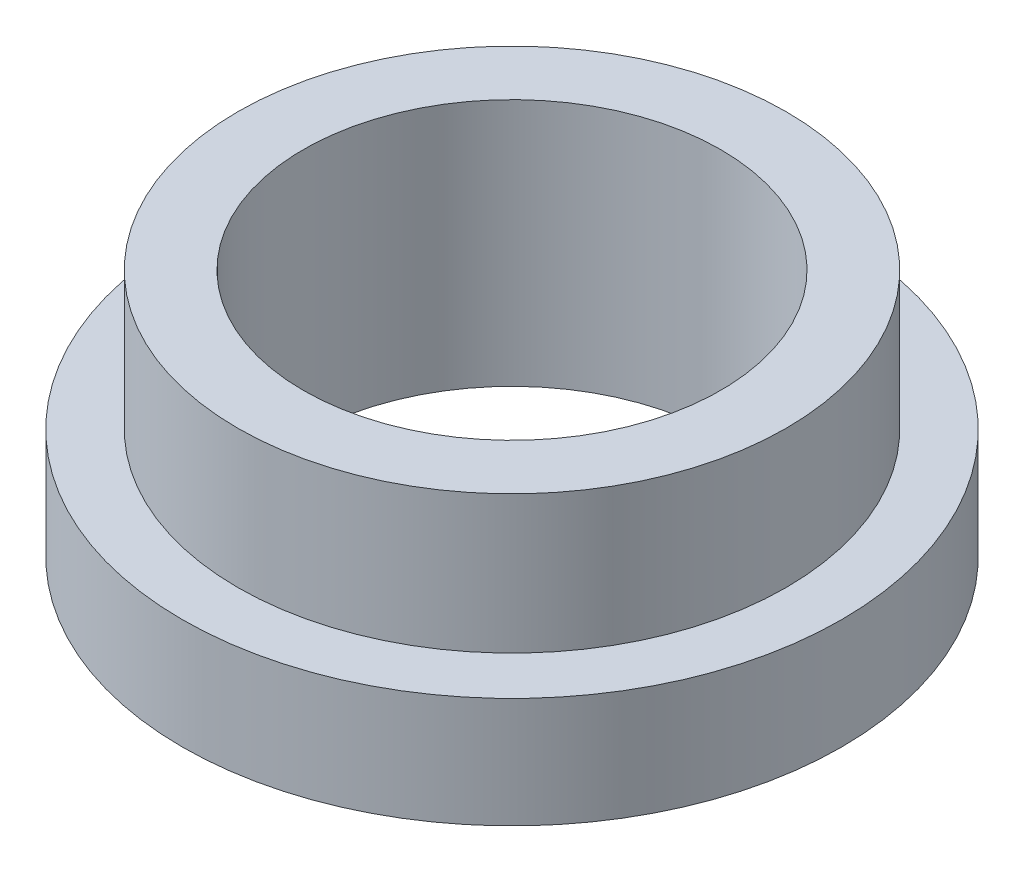
ISO-10303-21;
HEADER;
FILE_DESCRIPTION(('STEP AP214'),'2;1');
FILE_NAME('part.step','',(''),(''),'','','');
FILE_SCHEMA(('AUTOMOTIVE_DESIGN { 1 0 10303 214 1 1 1 1 }'));
ENDSEC;
DATA;
#1=APPLICATION_CONTEXT('core data for automotive mechanical design processes');
#2=APPLICATION_PROTOCOL_DEFINITION('international standard','automotive_design',2000,#1);
#3=PRODUCT_CONTEXT('',#1,'mechanical');
#4=PRODUCT('Part','Part','',(#3));
#5=PRODUCT_RELATED_PRODUCT_CATEGORY('part','',(#4));
#6=PRODUCT_DEFINITION_FORMATION('','',#4);
#7=PRODUCT_DEFINITION_CONTEXT('part definition',#1,'design');
#8=PRODUCT_DEFINITION('design','',#6,#7);
#9=PRODUCT_DEFINITION_SHAPE('','',#8);
#10=(LENGTH_UNIT() NAMED_UNIT(*) SI_UNIT(.MILLI.,.METRE.));
#11=(NAMED_UNIT(*) PLANE_ANGLE_UNIT() SI_UNIT($,.RADIAN.));
#12=(NAMED_UNIT(*) SI_UNIT($,.STERADIAN.) SOLID_ANGLE_UNIT());
#13=UNCERTAINTY_MEASURE_WITH_UNIT(LENGTH_MEASURE(1.E-05),#10,'distance_accuracy_value','');
#14=(GEOMETRIC_REPRESENTATION_CONTEXT(3) GLOBAL_UNCERTAINTY_ASSIGNED_CONTEXT((#13)) GLOBAL_UNIT_ASSIGNED_CONTEXT((#10,
#11,#12)) REPRESENTATION_CONTEXT('',''));
#15=CARTESIAN_POINT('',(0.,0.,0.));
#16=DIRECTION('',(0.,0.,1.));
#17=DIRECTION('',(1.,0.,0.));
#18=AXIS2_PLACEMENT_3D('',#15,#16,#17);
#19=CARTESIAN_POINT('',(0.,0.,0.));
#20=DIRECTION('',(0.,-1.,0.));
#21=DIRECTION('',(0.,0.,-1.));
#22=AXIS2_PLACEMENT_3D('',#19,#20,#21);
#23=CYLINDRICAL_SURFACE('',#22,3.975);
#24=CARTESIAN_POINT('',(0.,3.6,0.));
#25=DIRECTION('',(0.,-1.,0.));
#26=DIRECTION('',(0.,0.,-1.));
#27=AXIS2_PLACEMENT_3D('',#24,#25,#26);
#28=CIRCLE('',#27,3.975);
#29=CARTESIAN_POINT('',(0.,3.6,-3.975));
#30=VERTEX_POINT('',#29);
#31=EDGE_CURVE('E32',#30,#30,#28,.T.);
#32=ORIENTED_EDGE('',*,*,#31,.T.);
#33=EDGE_LOOP('',(#32));
#34=FACE_BOUND('',#33,.T.);
#35=CARTESIAN_POINT('',(0.,1.6,0.));
#36=DIRECTION('',(0.,-1.,0.));
#37=DIRECTION('',(0.,0.,-1.));
#38=AXIS2_PLACEMENT_3D('',#35,#36,#37);
#39=CIRCLE('',#38,3.975);
#40=CARTESIAN_POINT('',(0.,1.6,-3.975));
#41=VERTEX_POINT('',#40);
#42=EDGE_CURVE('E16',#41,#41,#39,.F.);
#43=ORIENTED_EDGE('',*,*,#42,.T.);
#44=EDGE_LOOP('',(#43));
#45=FACE_BOUND('',#44,.T.);
#46=ADVANCED_FACE('F13',(#34,#45),#23,.T.);
#47=CARTESIAN_POINT('',(-3.975,1.6,0.));
#48=DIRECTION('',(0.,-1.,0.));
#49=DIRECTION('',(0.,0.,-1.));
#50=AXIS2_PLACEMENT_3D('',#47,#48,#49);
#51=PLANE('',#50);
#52=ORIENTED_EDGE('',*,*,#42,.F.);
#53=EDGE_LOOP('',(#52));
#54=FACE_BOUND('',#53,.T.);
#55=CARTESIAN_POINT('',(0.,1.6,0.));
#56=DIRECTION('',(0.,-1.,0.));
#57=DIRECTION('',(0.,0.,-1.));
#58=AXIS2_PLACEMENT_3D('',#55,#56,#57);
#59=CIRCLE('',#58,4.78);
#60=CARTESIAN_POINT('',(0.,1.6,-4.78));
#61=VERTEX_POINT('',#60);
#62=EDGE_CURVE('E30',#61,#61,#59,.T.);
#63=ORIENTED_EDGE('',*,*,#62,.F.);
#64=EDGE_LOOP('',(#63));
#65=FACE_BOUND('',#64,.T.);
#66=ADVANCED_FACE('F40',(#54,#65),#51,.F.);
#67=CARTESIAN_POINT('',(-3.025,3.6,0.));
#68=DIRECTION('',(0.,-1.,0.));
#69=DIRECTION('',(0.,0.,-1.));
#70=AXIS2_PLACEMENT_3D('',#67,#68,#69);
#71=PLANE('',#70);
#72=CARTESIAN_POINT('',(0.,3.6,0.));
#73=DIRECTION('',(0.,-1.,0.));
#74=DIRECTION('',(0.,0.,-1.));
#75=AXIS2_PLACEMENT_3D('',#72,#73,#74);
#76=CIRCLE('',#75,3.025);
#77=CARTESIAN_POINT('',(0.,3.6,-3.025));
#78=VERTEX_POINT('',#77);
#79=EDGE_CURVE('E25',#78,#78,#76,.T.);
#80=ORIENTED_EDGE('',*,*,#79,.T.);
#81=EDGE_LOOP('',(#80));
#82=FACE_BOUND('',#81,.T.);
#83=ORIENTED_EDGE('',*,*,#31,.F.);
#84=EDGE_LOOP('',(#83));
#85=FACE_BOUND('',#84,.T.);
#86=ADVANCED_FACE('F43',(#82,#85),#71,.F.);
#87=CARTESIAN_POINT('',(0.,0.,0.));
#88=DIRECTION('',(0.,-1.,0.));
#89=DIRECTION('',(0.,0.,-1.));
#90=AXIS2_PLACEMENT_3D('',#87,#88,#89);
#91=CYLINDRICAL_SURFACE('',#90,4.78);
#92=ORIENTED_EDGE('',*,*,#62,.T.);
#93=EDGE_LOOP('',(#92));
#94=FACE_BOUND('',#93,.T.);
#95=CARTESIAN_POINT('',(0.,0.,0.));
#96=DIRECTION('',(0.,-1.,0.));
#97=DIRECTION('',(0.,0.,-1.));
#98=AXIS2_PLACEMENT_3D('',#95,#96,#97);
#99=CIRCLE('',#98,4.78);
#100=CARTESIAN_POINT('',(0.,0.,-4.78));
#101=VERTEX_POINT('',#100);
#102=EDGE_CURVE('E20',#101,#101,#99,.F.);
#103=ORIENTED_EDGE('',*,*,#102,.T.);
#104=EDGE_LOOP('',(#103));
#105=FACE_BOUND('',#104,.T.);
#106=ADVANCED_FACE('F46',(#94,#105),#91,.T.);
#107=CARTESIAN_POINT('',(0.,0.,0.));
#108=DIRECTION('',(0.,-1.,0.));
#109=DIRECTION('',(0.,0.,-1.));
#110=AXIS2_PLACEMENT_3D('',#107,#108,#109);
#111=CYLINDRICAL_SURFACE('',#110,3.025);
#112=CARTESIAN_POINT('',(0.,0.,0.));
#113=DIRECTION('',(0.,-1.,0.));
#114=DIRECTION('',(0.,0.,-1.));
#115=AXIS2_PLACEMENT_3D('',#112,#113,#114);
#116=CIRCLE('',#115,3.025);
#117=CARTESIAN_POINT('',(0.,0.,-3.025));
#118=VERTEX_POINT('',#117);
#119=EDGE_CURVE('E9',#118,#118,#116,.T.);
#120=ORIENTED_EDGE('',*,*,#119,.T.);
#121=EDGE_LOOP('',(#120));
#122=FACE_BOUND('',#121,.T.);
#123=ORIENTED_EDGE('',*,*,#79,.F.);
#124=EDGE_LOOP('',(#123));
#125=FACE_BOUND('',#124,.T.);
#126=ADVANCED_FACE('F49',(#122,#125),#111,.F.);
#127=CARTESIAN_POINT('',(-4.78,0.,0.));
#128=DIRECTION('',(0.,1.,0.));
#129=DIRECTION('',(0.,0.,1.));
#130=AXIS2_PLACEMENT_3D('',#127,#128,#129);
#131=PLANE('',#130);
#132=ORIENTED_EDGE('',*,*,#119,.F.);
#133=EDGE_LOOP('',(#132));
#134=FACE_BOUND('',#133,.T.);
#135=ORIENTED_EDGE('',*,*,#102,.F.);
#136=EDGE_LOOP('',(#135));
#137=FACE_BOUND('',#136,.T.);
#138=ADVANCED_FACE('F53',(#134,#137),#131,.F.);
#139=CLOSED_SHELL('',(#46,#66,#86,#106,#126,#138));
#140=MANIFOLD_SOLID_BREP('B1',#139);
#141=ADVANCED_BREP_SHAPE_REPRESENTATION('',(#18,#140),#14);
#142=SHAPE_DEFINITION_REPRESENTATION(#9,#141);
ENDSEC;
END-ISO-10303-21;
